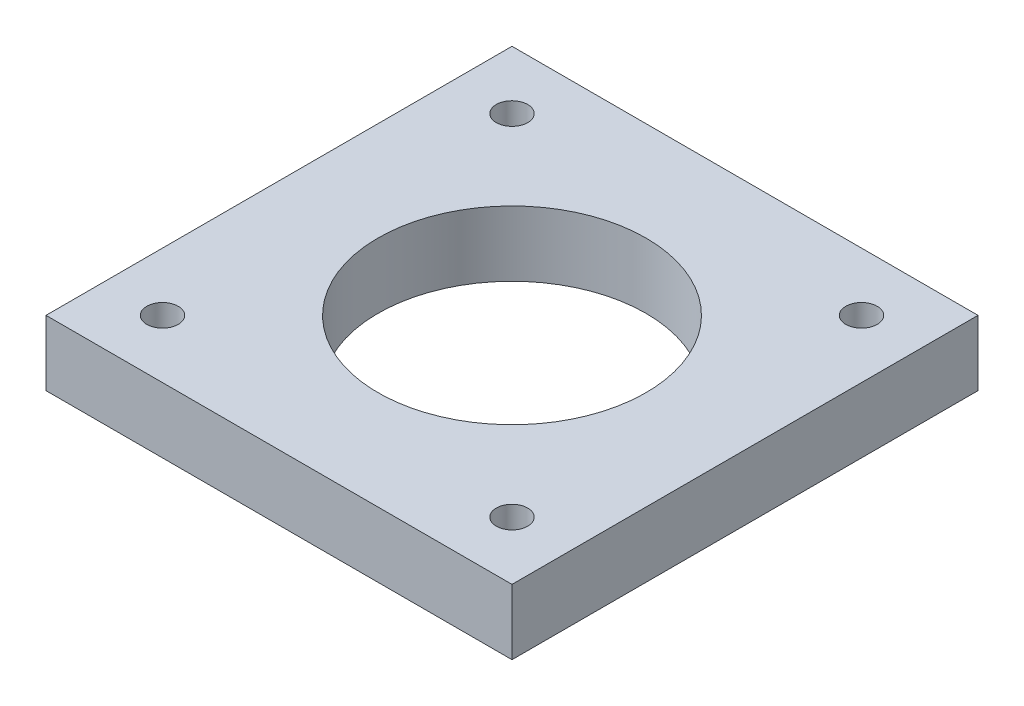
ISO-10303-21;
HEADER;
FILE_DESCRIPTION(('STEP AP214'),'2;1');
FILE_NAME('part.step','',(''),(''),'','','');
FILE_SCHEMA(('AUTOMOTIVE_DESIGN { 1 0 10303 214 1 1 1 1 }'));
ENDSEC;
DATA;
#1=APPLICATION_CONTEXT('core data for automotive mechanical design processes');
#2=APPLICATION_PROTOCOL_DEFINITION('international standard','automotive_design',2000,#1);
#3=PRODUCT_CONTEXT('',#1,'mechanical');
#4=PRODUCT('Part','Part','',(#3));
#5=PRODUCT_RELATED_PRODUCT_CATEGORY('part','',(#4));
#6=PRODUCT_DEFINITION_FORMATION('','',#4);
#7=PRODUCT_DEFINITION_CONTEXT('part definition',#1,'design');
#8=PRODUCT_DEFINITION('design','',#6,#7);
#9=PRODUCT_DEFINITION_SHAPE('','',#8);
#10=(LENGTH_UNIT() NAMED_UNIT(*) SI_UNIT(.MILLI.,.METRE.));
#11=(NAMED_UNIT(*) PLANE_ANGLE_UNIT() SI_UNIT($,.RADIAN.));
#12=(NAMED_UNIT(*) SI_UNIT($,.STERADIAN.) SOLID_ANGLE_UNIT());
#13=UNCERTAINTY_MEASURE_WITH_UNIT(LENGTH_MEASURE(1.E-05),#10,'distance_accuracy_value','');
#14=(GEOMETRIC_REPRESENTATION_CONTEXT(3) GLOBAL_UNCERTAINTY_ASSIGNED_CONTEXT((#13)) GLOBAL_UNIT_ASSIGNED_CONTEXT((#10,
#11,#12)) REPRESENTATION_CONTEXT('',''));
#15=CARTESIAN_POINT('',(0.,0.,0.));
#16=DIRECTION('',(0.,0.,1.));
#17=DIRECTION('',(1.,0.,0.));
#18=AXIS2_PLACEMENT_3D('',#15,#16,#17);
#19=CARTESIAN_POINT('',(-20.,5.6,-20.));
#20=DIRECTION('',(0.,0.,1.));
#21=DIRECTION('',(1.,0.,0.));
#22=AXIS2_PLACEMENT_3D('',#19,#20,#21);
#23=PLANE('',#22);
#24=DIRECTION('',(-1.,0.,0.));
#25=VECTOR('',#24,1.);
#26=CARTESIAN_POINT('',(-20.,0.,-20.));
#27=LINE('',#26,#25);
#28=CARTESIAN_POINT('',(20.,0.,-20.));
#29=VERTEX_POINT('',#28);
#30=CARTESIAN_POINT('',(-20.,0.,-20.));
#31=VERTEX_POINT('',#30);
#32=EDGE_CURVE('E111',#29,#31,#27,.T.);
#33=ORIENTED_EDGE('',*,*,#32,.T.);
#34=DIRECTION('',(0.,-1.,0.));
#35=VECTOR('',#34,1.);
#36=CARTESIAN_POINT('',(-20.,5.6,-20.));
#37=LINE('',#36,#35);
#38=CARTESIAN_POINT('',(-20.,5.6,-20.));
#39=VERTEX_POINT('',#38);
#40=EDGE_CURVE('E11',#39,#31,#37,.T.);
#41=ORIENTED_EDGE('',*,*,#40,.F.);
#42=DIRECTION('',(-1.,0.,0.));
#43=VECTOR('',#42,1.);
#44=CARTESIAN_POINT('',(-20.,5.6,-20.));
#45=LINE('',#44,#43);
#46=CARTESIAN_POINT('',(20.,5.6,-20.));
#47=VERTEX_POINT('',#46);
#48=EDGE_CURVE('E95',#47,#39,#45,.T.);
#49=ORIENTED_EDGE('',*,*,#48,.F.);
#50=DIRECTION('',(0.,-1.,0.));
#51=VECTOR('',#50,1.);
#52=CARTESIAN_POINT('',(20.,5.6,-20.));
#53=LINE('',#52,#51);
#54=EDGE_CURVE('E107',#47,#29,#53,.T.);
#55=ORIENTED_EDGE('',*,*,#54,.T.);
#56=EDGE_LOOP('',(#33,#41,#49,#55));
#57=FACE_BOUND('',#56,.T.);
#58=ADVANCED_FACE('F43',(#57),#23,.F.);
#59=CARTESIAN_POINT('',(-20.,5.6,-20.));
#60=DIRECTION('',(1.,0.,0.));
#61=DIRECTION('',(0.,0.,-1.));
#62=AXIS2_PLACEMENT_3D('',#59,#60,#61);
#63=PLANE('',#62);
#64=DIRECTION('',(0.,0.,1.));
#65=VECTOR('',#64,1.);
#66=CARTESIAN_POINT('',(-20.,0.,-20.));
#67=LINE('',#66,#65);
#68=CARTESIAN_POINT('',(-20.,0.,20.));
#69=VERTEX_POINT('',#68);
#70=EDGE_CURVE('E100',#31,#69,#67,.T.);
#71=ORIENTED_EDGE('',*,*,#70,.T.);
#72=DIRECTION('',(0.,-1.,0.));
#73=VECTOR('',#72,1.);
#74=CARTESIAN_POINT('',(-20.,5.6,20.));
#75=LINE('',#74,#73);
#76=CARTESIAN_POINT('',(-20.,5.6,20.));
#77=VERTEX_POINT('',#76);
#78=EDGE_CURVE('E52',#77,#69,#75,.T.);
#79=ORIENTED_EDGE('',*,*,#78,.F.);
#80=DIRECTION('',(0.,0.,1.));
#81=VECTOR('',#80,1.);
#82=CARTESIAN_POINT('',(-20.,5.6,-20.));
#83=LINE('',#82,#81);
#84=EDGE_CURVE('E90',#39,#77,#83,.T.);
#85=ORIENTED_EDGE('',*,*,#84,.F.);
#86=ORIENTED_EDGE('',*,*,#40,.T.);
#87=EDGE_LOOP('',(#71,#79,#85,#86));
#88=FACE_BOUND('',#87,.T.);
#89=ADVANCED_FACE('F99',(#88),#63,.F.);
#90=CARTESIAN_POINT('',(-20.,5.6,20.));
#91=DIRECTION('',(0.,0.,-1.));
#92=DIRECTION('',(-1.,0.,0.));
#93=AXIS2_PLACEMENT_3D('',#90,#91,#92);
#94=PLANE('',#93);
#95=DIRECTION('',(1.,0.,0.));
#96=VECTOR('',#95,1.);
#97=CARTESIAN_POINT('',(-20.,0.,20.));
#98=LINE('',#97,#96);
#99=CARTESIAN_POINT('',(20.,0.,20.));
#100=VERTEX_POINT('',#99);
#101=EDGE_CURVE('E77',#69,#100,#98,.T.);
#102=ORIENTED_EDGE('',*,*,#101,.T.);
#103=DIRECTION('',(0.,-1.,0.));
#104=VECTOR('',#103,1.);
#105=CARTESIAN_POINT('',(20.,5.6,20.));
#106=LINE('',#105,#104);
#107=CARTESIAN_POINT('',(20.,5.6,20.));
#108=VERTEX_POINT('',#107);
#109=EDGE_CURVE('E102',#108,#100,#106,.T.);
#110=ORIENTED_EDGE('',*,*,#109,.F.);
#111=DIRECTION('',(1.,0.,0.));
#112=VECTOR('',#111,1.);
#113=CARTESIAN_POINT('',(-20.,5.6,20.));
#114=LINE('',#113,#112);
#115=EDGE_CURVE('E93',#77,#108,#114,.T.);
#116=ORIENTED_EDGE('',*,*,#115,.F.);
#117=ORIENTED_EDGE('',*,*,#78,.T.);
#118=EDGE_LOOP('',(#102,#110,#116,#117));
#119=FACE_BOUND('',#118,.T.);
#120=ADVANCED_FACE('F103',(#119),#94,.F.);
#121=CARTESIAN_POINT('',(20.,5.6,-20.));
#122=DIRECTION('',(-1.,0.,0.));
#123=DIRECTION('',(0.,0.,1.));
#124=AXIS2_PLACEMENT_3D('',#121,#122,#123);
#125=PLANE('',#124);
#126=DIRECTION('',(0.,0.,-1.));
#127=VECTOR('',#126,1.);
#128=CARTESIAN_POINT('',(20.,0.,-20.));
#129=LINE('',#128,#127);
#130=EDGE_CURVE('E83',#100,#29,#129,.T.);
#131=ORIENTED_EDGE('',*,*,#130,.T.);
#132=ORIENTED_EDGE('',*,*,#54,.F.);
#133=DIRECTION('',(0.,0.,-1.));
#134=VECTOR('',#133,1.);
#135=CARTESIAN_POINT('',(20.,5.6,-20.));
#136=LINE('',#135,#134);
#137=EDGE_CURVE('E60',#108,#47,#136,.T.);
#138=ORIENTED_EDGE('',*,*,#137,.F.);
#139=ORIENTED_EDGE('',*,*,#109,.T.);
#140=EDGE_LOOP('',(#131,#132,#138,#139));
#141=FACE_BOUND('',#140,.T.);
#142=ADVANCED_FACE('F125',(#141),#125,.F.);
#143=CARTESIAN_POINT('',(0.,5.6,0.));
#144=DIRECTION('',(0.,-1.,0.));
#145=DIRECTION('',(0.,0.,-1.));
#146=AXIS2_PLACEMENT_3D('',#143,#144,#145);
#147=PLANE('',#146);
#148=CARTESIAN_POINT('',(-15.,5.6,15.));
#149=DIRECTION('',(0.,1.,0.));
#150=DIRECTION('',(0.,0.,-1.));
#151=AXIS2_PLACEMENT_3D('',#148,#149,#150);
#152=CIRCLE('',#151,1.35);
#153=CARTESIAN_POINT('',(-15.,5.6,13.65));
#154=VERTEX_POINT('',#153);
#155=EDGE_CURVE('E152',#154,#154,#152,.T.);
#156=ORIENTED_EDGE('',*,*,#155,.F.);
#157=EDGE_LOOP('',(#156));
#158=FACE_BOUND('',#157,.T.);
#159=CARTESIAN_POINT('',(15.,5.6,15.));
#160=DIRECTION('',(0.,1.,0.));
#161=DIRECTION('',(0.,0.,1.));
#162=AXIS2_PLACEMENT_3D('',#159,#160,#161);
#163=CIRCLE('',#162,1.35);
#164=CARTESIAN_POINT('',(15.,5.6,16.35));
#165=VERTEX_POINT('',#164);
#166=EDGE_CURVE('E160',#165,#165,#163,.T.);
#167=ORIENTED_EDGE('',*,*,#166,.F.);
#168=EDGE_LOOP('',(#167));
#169=FACE_BOUND('',#168,.T.);
#170=CARTESIAN_POINT('',(15.,5.6,-15.));
#171=DIRECTION('',(0.,1.,0.));
#172=DIRECTION('',(0.,0.,-1.));
#173=AXIS2_PLACEMENT_3D('',#170,#171,#172);
#174=CIRCLE('',#173,1.35);
#175=CARTESIAN_POINT('',(15.,5.6,-16.35));
#176=VERTEX_POINT('',#175);
#177=EDGE_CURVE('E144',#176,#176,#174,.T.);
#178=ORIENTED_EDGE('',*,*,#177,.F.);
#179=EDGE_LOOP('',(#178));
#180=FACE_BOUND('',#179,.T.);
#181=CARTESIAN_POINT('',(-15.,5.6,-15.));
#182=DIRECTION('',(0.,1.,0.));
#183=DIRECTION('',(0.,0.,1.));
#184=AXIS2_PLACEMENT_3D('',#181,#182,#183);
#185=CIRCLE('',#184,1.35);
#186=CARTESIAN_POINT('',(-15.,5.6,-13.65));
#187=VERTEX_POINT('',#186);
#188=EDGE_CURVE('E140',#187,#187,#185,.T.);
#189=ORIENTED_EDGE('',*,*,#188,.F.);
#190=EDGE_LOOP('',(#189));
#191=FACE_BOUND('',#190,.T.);
#192=CARTESIAN_POINT('',(0.,5.6,0.));
#193=DIRECTION('',(0.,-1.,0.));
#194=DIRECTION('',(0.,0.,-1.));
#195=AXIS2_PLACEMENT_3D('',#192,#193,#194);
#196=CIRCLE('',#195,11.5);
#197=CARTESIAN_POINT('',(0.,5.6,-11.5));
#198=VERTEX_POINT('',#197);
#199=EDGE_CURVE('E115',#198,#198,#196,.T.);
#200=ORIENTED_EDGE('',*,*,#199,.T.);
#201=EDGE_LOOP('',(#200));
#202=FACE_BOUND('',#201,.T.);
#203=ORIENTED_EDGE('',*,*,#48,.T.);
#204=ORIENTED_EDGE('',*,*,#84,.T.);
#205=ORIENTED_EDGE('',*,*,#115,.T.);
#206=ORIENTED_EDGE('',*,*,#137,.T.);
#207=EDGE_LOOP('',(#203,#204,#205,#206));
#208=FACE_BOUND('',#207,.T.);
#209=ADVANCED_FACE('F91',(#158,#169,#180,#191,#202,#208),#147,.F.);
#210=CARTESIAN_POINT('',(0.,0.,0.));
#211=DIRECTION('',(0.,-1.,0.));
#212=DIRECTION('',(0.,0.,-1.));
#213=AXIS2_PLACEMENT_3D('',#210,#211,#212);
#214=PLANE('',#213);
#215=CARTESIAN_POINT('',(-15.,0.,15.));
#216=DIRECTION('',(0.,1.,0.));
#217=DIRECTION('',(0.,0.,-1.));
#218=AXIS2_PLACEMENT_3D('',#215,#216,#217);
#219=CIRCLE('',#218,1.35);
#220=CARTESIAN_POINT('',(-15.,0.,13.65));
#221=VERTEX_POINT('',#220);
#222=EDGE_CURVE('E148',#221,#221,#219,.T.);
#223=ORIENTED_EDGE('',*,*,#222,.T.);
#224=EDGE_LOOP('',(#223));
#225=FACE_BOUND('',#224,.T.);
#226=CARTESIAN_POINT('',(15.,0.,15.));
#227=DIRECTION('',(0.,1.,0.));
#228=DIRECTION('',(0.,0.,1.));
#229=AXIS2_PLACEMENT_3D('',#226,#227,#228);
#230=CIRCLE('',#229,1.35);
#231=CARTESIAN_POINT('',(15.,0.,16.35));
#232=VERTEX_POINT('',#231);
#233=EDGE_CURVE('E156',#232,#232,#230,.T.);
#234=ORIENTED_EDGE('',*,*,#233,.T.);
#235=EDGE_LOOP('',(#234));
#236=FACE_BOUND('',#235,.T.);
#237=CARTESIAN_POINT('',(15.,0.,-15.));
#238=DIRECTION('',(0.,1.,0.));
#239=DIRECTION('',(0.,0.,-1.));
#240=AXIS2_PLACEMENT_3D('',#237,#238,#239);
#241=CIRCLE('',#240,1.35);
#242=CARTESIAN_POINT('',(15.,0.,-16.35));
#243=VERTEX_POINT('',#242);
#244=EDGE_CURVE('E164',#243,#243,#241,.T.);
#245=ORIENTED_EDGE('',*,*,#244,.T.);
#246=EDGE_LOOP('',(#245));
#247=FACE_BOUND('',#246,.T.);
#248=CARTESIAN_POINT('',(-15.,0.,-15.));
#249=DIRECTION('',(0.,1.,0.));
#250=DIRECTION('',(0.,0.,1.));
#251=AXIS2_PLACEMENT_3D('',#248,#249,#250);
#252=CIRCLE('',#251,1.35);
#253=CARTESIAN_POINT('',(-15.,0.,-13.65));
#254=VERTEX_POINT('',#253);
#255=EDGE_CURVE('E139',#254,#254,#252,.T.);
#256=ORIENTED_EDGE('',*,*,#255,.T.);
#257=EDGE_LOOP('',(#256));
#258=FACE_BOUND('',#257,.T.);
#259=CARTESIAN_POINT('',(0.,0.,0.));
#260=DIRECTION('',(0.,-1.,0.));
#261=DIRECTION('',(0.,0.,-1.));
#262=AXIS2_PLACEMENT_3D('',#259,#260,#261);
#263=CIRCLE('',#262,11.5);
#264=CARTESIAN_POINT('',(0.,0.,-11.5));
#265=VERTEX_POINT('',#264);
#266=EDGE_CURVE('E135',#265,#265,#263,.T.);
#267=ORIENTED_EDGE('',*,*,#266,.F.);
#268=EDGE_LOOP('',(#267));
#269=FACE_BOUND('',#268,.T.);
#270=ORIENTED_EDGE('',*,*,#32,.F.);
#271=ORIENTED_EDGE('',*,*,#130,.F.);
#272=ORIENTED_EDGE('',*,*,#101,.F.);
#273=ORIENTED_EDGE('',*,*,#70,.F.);
#274=EDGE_LOOP('',(#270,#271,#272,#273));
#275=FACE_BOUND('',#274,.T.);
#276=ADVANCED_FACE('F128',(#225,#236,#247,#258,#269,#275),#214,.T.);
#277=CARTESIAN_POINT('',(0.,7.5,0.));
#278=DIRECTION('',(0.,-1.,0.));
#279=DIRECTION('',(0.,0.,-1.));
#280=AXIS2_PLACEMENT_3D('',#277,#278,#279);
#281=CYLINDRICAL_SURFACE('',#280,11.5);
#282=ORIENTED_EDGE('',*,*,#266,.T.);
#283=EDGE_LOOP('',(#282));
#284=FACE_BOUND('',#283,.T.);
#285=ORIENTED_EDGE('',*,*,#199,.F.);
#286=EDGE_LOOP('',(#285));
#287=FACE_BOUND('',#286,.T.);
#288=ADVANCED_FACE('F182',(#284,#287),#281,.F.);
#289=CARTESIAN_POINT('',(-15.,0.,-15.));
#290=DIRECTION('',(0.,1.,0.));
#291=DIRECTION('',(0.,0.,1.));
#292=AXIS2_PLACEMENT_3D('',#289,#290,#291);
#293=CYLINDRICAL_SURFACE('',#292,1.35);
#294=ORIENTED_EDGE('',*,*,#255,.F.);
#295=EDGE_LOOP('',(#294));
#296=FACE_BOUND('',#295,.T.);
#297=ORIENTED_EDGE('',*,*,#188,.T.);
#298=EDGE_LOOP('',(#297));
#299=FACE_BOUND('',#298,.T.);
#300=ADVANCED_FACE('F184',(#296,#299),#293,.F.);
#301=CARTESIAN_POINT('',(15.,0.,-15.));
#302=DIRECTION('',(0.,1.,0.));
#303=DIRECTION('',(0.,0.,1.));
#304=AXIS2_PLACEMENT_3D('',#301,#302,#303);
#305=CYLINDRICAL_SURFACE('',#304,1.35);
#306=ORIENTED_EDGE('',*,*,#244,.F.);
#307=EDGE_LOOP('',(#306));
#308=FACE_BOUND('',#307,.T.);
#309=ORIENTED_EDGE('',*,*,#177,.T.);
#310=EDGE_LOOP('',(#309));
#311=FACE_BOUND('',#310,.T.);
#312=ADVANCED_FACE('F172',(#308,#311),#305,.F.);
#313=CARTESIAN_POINT('',(15.,0.,15.));
#314=DIRECTION('',(0.,1.,0.));
#315=DIRECTION('',(0.,0.,1.));
#316=AXIS2_PLACEMENT_3D('',#313,#314,#315);
#317=CYLINDRICAL_SURFACE('',#316,1.35);
#318=ORIENTED_EDGE('',*,*,#233,.F.);
#319=EDGE_LOOP('',(#318));
#320=FACE_BOUND('',#319,.T.);
#321=ORIENTED_EDGE('',*,*,#166,.T.);
#322=EDGE_LOOP('',(#321));
#323=FACE_BOUND('',#322,.T.);
#324=ADVANCED_FACE('F235',(#320,#323),#317,.F.);
#325=CARTESIAN_POINT('',(-15.,0.,15.));
#326=DIRECTION('',(0.,1.,0.));
#327=DIRECTION('',(0.,0.,1.));
#328=AXIS2_PLACEMENT_3D('',#325,#326,#327);
#329=CYLINDRICAL_SURFACE('',#328,1.35);
#330=ORIENTED_EDGE('',*,*,#222,.F.);
#331=EDGE_LOOP('',(#330));
#332=FACE_BOUND('',#331,.T.);
#333=ORIENTED_EDGE('',*,*,#155,.T.);
#334=EDGE_LOOP('',(#333));
#335=FACE_BOUND('',#334,.T.);
#336=ADVANCED_FACE('F246',(#332,#335),#329,.F.);
#337=CLOSED_SHELL('',(#58,#89,#120,#142,#209,#276,#288,#300,#312,#324,#336));
#338=MANIFOLD_SOLID_BREP('B2',#337);
#339=ADVANCED_BREP_SHAPE_REPRESENTATION('',(#18,#338),#14);
#340=SHAPE_DEFINITION_REPRESENTATION(#9,#339);
ENDSEC;
END-ISO-10303-21;
